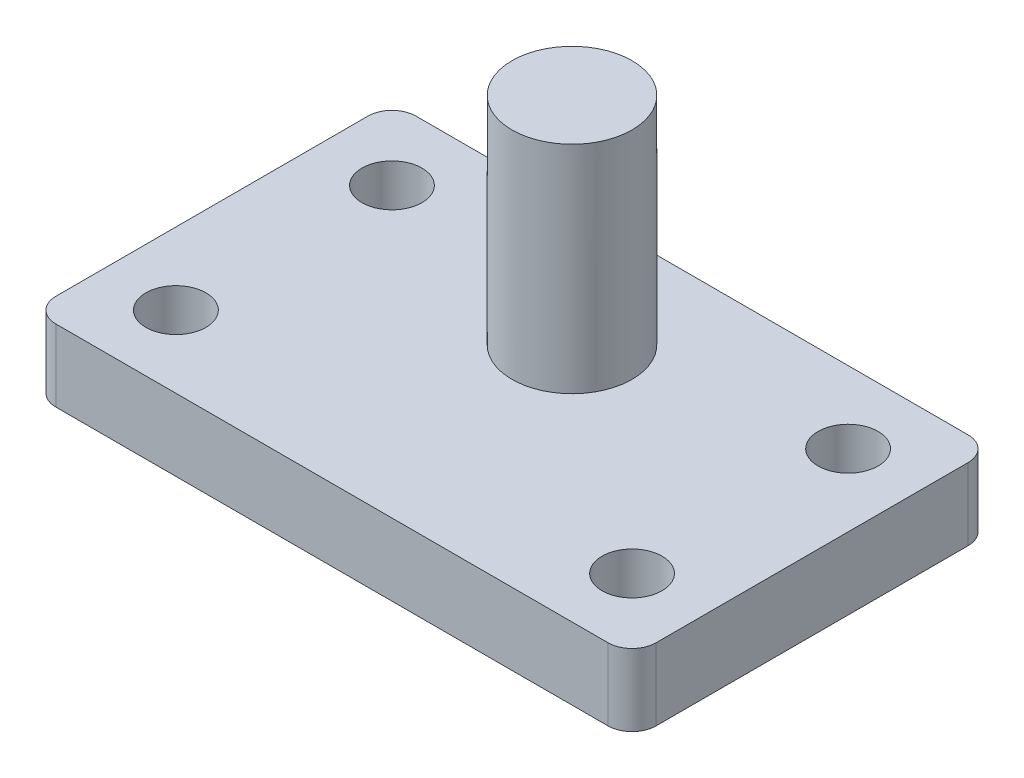
ISO-10303-21;
HEADER;
FILE_DESCRIPTION(('STEP AP214'),'2;1');
FILE_NAME('part.step','',(''),(''),'','','');
FILE_SCHEMA(('AUTOMOTIVE_DESIGN { 1 0 10303 214 1 1 1 1 }'));
ENDSEC;
DATA;
#1=APPLICATION_CONTEXT('core data for automotive mechanical design processes');
#2=APPLICATION_PROTOCOL_DEFINITION('international standard','automotive_design',2000,#1);
#3=PRODUCT_CONTEXT('',#1,'mechanical');
#4=PRODUCT('Part','Part','',(#3));
#5=PRODUCT_RELATED_PRODUCT_CATEGORY('part','',(#4));
#6=PRODUCT_DEFINITION_FORMATION('','',#4);
#7=PRODUCT_DEFINITION_CONTEXT('part definition',#1,'design');
#8=PRODUCT_DEFINITION('design','',#6,#7);
#9=PRODUCT_DEFINITION_SHAPE('','',#8);
#10=(LENGTH_UNIT() NAMED_UNIT(*) SI_UNIT(.MILLI.,.METRE.));
#11=(NAMED_UNIT(*) PLANE_ANGLE_UNIT() SI_UNIT($,.RADIAN.));
#12=(NAMED_UNIT(*) SI_UNIT($,.STERADIAN.) SOLID_ANGLE_UNIT());
#13=UNCERTAINTY_MEASURE_WITH_UNIT(LENGTH_MEASURE(1.E-05),#10,'distance_accuracy_value','');
#14=(GEOMETRIC_REPRESENTATION_CONTEXT(3) GLOBAL_UNCERTAINTY_ASSIGNED_CONTEXT((#13)) GLOBAL_UNIT_ASSIGNED_CONTEXT((#10,
#11,#12)) REPRESENTATION_CONTEXT('',''));
#15=CARTESIAN_POINT('',(0.,0.,0.));
#16=DIRECTION('',(0.,0.,1.));
#17=DIRECTION('',(1.,0.,0.));
#18=AXIS2_PLACEMENT_3D('',#15,#16,#17);
#19=CARTESIAN_POINT('',(-115.,30.,65.));
#20=DIRECTION('',(0.,-1.,0.));
#21=DIRECTION('',(0.,0.,-1.));
#22=AXIS2_PLACEMENT_3D('',#19,#20,#21);
#23=PLANE('',#22);
#24=CARTESIAN_POINT('',(-95.,30.,45.));
#25=DIRECTION('',(0.,1.,0.));
#26=DIRECTION('',(0.,0.,-1.));
#27=AXIS2_PLACEMENT_3D('',#24,#25,#26);
#28=CIRCLE('',#27,12.5);
#29=CARTESIAN_POINT('',(-95.,30.,32.5));
#30=VERTEX_POINT('',#29);
#31=EDGE_CURVE('E204',#30,#30,#28,.T.);
#32=ORIENTED_EDGE('',*,*,#31,.F.);
#33=EDGE_LOOP('',(#32));
#34=FACE_BOUND('',#33,.T.);
#35=CARTESIAN_POINT('',(95.,30.,45.));
#36=DIRECTION('',(0.,1.,0.));
#37=DIRECTION('',(0.,0.,-1.));
#38=AXIS2_PLACEMENT_3D('',#35,#36,#37);
#39=CIRCLE('',#38,12.5);
#40=CARTESIAN_POINT('',(95.,30.,32.5));
#41=VERTEX_POINT('',#40);
#42=EDGE_CURVE('E198',#41,#41,#39,.T.);
#43=ORIENTED_EDGE('',*,*,#42,.F.);
#44=EDGE_LOOP('',(#43));
#45=FACE_BOUND('',#44,.T.);
#46=CARTESIAN_POINT('',(95.,30.,-45.));
#47=DIRECTION('',(0.,1.,0.));
#48=DIRECTION('',(0.,0.,1.));
#49=AXIS2_PLACEMENT_3D('',#46,#47,#48);
#50=CIRCLE('',#49,12.5);
#51=CARTESIAN_POINT('',(95.,30.,-32.5));
#52=VERTEX_POINT('',#51);
#53=EDGE_CURVE('E192',#52,#52,#50,.T.);
#54=ORIENTED_EDGE('',*,*,#53,.F.);
#55=EDGE_LOOP('',(#54));
#56=FACE_BOUND('',#55,.T.);
#57=CARTESIAN_POINT('',(-95.,30.,-45.));
#58=DIRECTION('',(0.,1.,0.));
#59=DIRECTION('',(0.,0.,1.));
#60=AXIS2_PLACEMENT_3D('',#57,#58,#59);
#61=CIRCLE('',#60,12.5);
#62=CARTESIAN_POINT('',(-95.,30.,-32.5));
#63=VERTEX_POINT('',#62);
#64=EDGE_CURVE('E186',#63,#63,#61,.T.);
#65=ORIENTED_EDGE('',*,*,#64,.F.);
#66=EDGE_LOOP('',(#65));
#67=FACE_BOUND('',#66,.T.);
#68=CARTESIAN_POINT('',(-115.,30.,65.));
#69=DIRECTION('',(0.,1.,0.));
#70=DIRECTION('',(0.,0.,-1.));
#71=AXIS2_PLACEMENT_3D('',#68,#69,#70);
#72=CIRCLE('',#71,9.99999999999999);
#73=CARTESIAN_POINT('',(-125.,30.,64.9999999999999));
#74=VERTEX_POINT('',#73);
#75=CARTESIAN_POINT('',(-115.,30.,75.));
#76=VERTEX_POINT('',#75);
#77=EDGE_CURVE('E146',#74,#76,#72,.T.);
#78=ORIENTED_EDGE('',*,*,#77,.T.);
#79=DIRECTION('',(1.,0.,0.));
#80=VECTOR('',#79,1.);
#81=CARTESIAN_POINT('',(115.,30.,75.));
#82=LINE('',#81,#80);
#83=CARTESIAN_POINT('',(115.,30.,75.));
#84=VERTEX_POINT('',#83);
#85=EDGE_CURVE('E94',#76,#84,#82,.T.);
#86=ORIENTED_EDGE('',*,*,#85,.T.);
#87=CARTESIAN_POINT('',(115.,30.,65.));
#88=DIRECTION('',(0.,1.,0.));
#89=DIRECTION('',(0.,0.,1.));
#90=AXIS2_PLACEMENT_3D('',#87,#88,#89);
#91=CIRCLE('',#90,9.99999999999999);
#92=CARTESIAN_POINT('',(125.,30.,64.9999999999999));
#93=VERTEX_POINT('',#92);
#94=EDGE_CURVE('E177',#84,#93,#91,.T.);
#95=ORIENTED_EDGE('',*,*,#94,.T.);
#96=DIRECTION('',(0.,0.,-1.));
#97=VECTOR('',#96,1.);
#98=CARTESIAN_POINT('',(125.,30.,64.9999999999999));
#99=LINE('',#98,#97);
#100=CARTESIAN_POINT('',(125.,30.,-64.9999999999999));
#101=VERTEX_POINT('',#100);
#102=EDGE_CURVE('E176',#93,#101,#99,.T.);
#103=ORIENTED_EDGE('',*,*,#102,.T.);
#104=CARTESIAN_POINT('',(115.,30.,-65.));
#105=DIRECTION('',(0.,1.,0.));
#106=DIRECTION('',(0.,0.,1.));
#107=AXIS2_PLACEMENT_3D('',#104,#105,#106);
#108=CIRCLE('',#107,9.99999999999999);
#109=CARTESIAN_POINT('',(115.,30.,-75.));
#110=VERTEX_POINT('',#109);
#111=EDGE_CURVE('E113',#101,#110,#108,.T.);
#112=ORIENTED_EDGE('',*,*,#111,.T.);
#113=DIRECTION('',(-1.,0.,0.));
#114=VECTOR('',#113,1.);
#115=CARTESIAN_POINT('',(115.,30.,-75.));
#116=LINE('',#115,#114);
#117=CARTESIAN_POINT('',(-115.,30.,-75.));
#118=VERTEX_POINT('',#117);
#119=EDGE_CURVE('E107',#110,#118,#116,.T.);
#120=ORIENTED_EDGE('',*,*,#119,.T.);
#121=CARTESIAN_POINT('',(-115.,30.,-65.));
#122=DIRECTION('',(0.,1.,0.));
#123=DIRECTION('',(0.,0.,1.));
#124=AXIS2_PLACEMENT_3D('',#121,#122,#123);
#125=CIRCLE('',#124,9.99999999999999);
#126=CARTESIAN_POINT('',(-125.,30.,-64.9999999999999));
#127=VERTEX_POINT('',#126);
#128=EDGE_CURVE('E111',#118,#127,#125,.T.);
#129=ORIENTED_EDGE('',*,*,#128,.T.);
#130=DIRECTION('',(0.,0.,1.));
#131=VECTOR('',#130,1.);
#132=CARTESIAN_POINT('',(-125.,30.,64.9999999999999));
#133=LINE('',#132,#131);
#134=EDGE_CURVE('E50',#127,#74,#133,.T.);
#135=ORIENTED_EDGE('',*,*,#134,.T.);
#136=EDGE_LOOP('',(#78,#86,#95,#103,#112,#120,#129,#135));
#137=FACE_BOUND('',#136,.T.);
#138=CARTESIAN_POINT('',(0.,30.,-25.));
#139=DIRECTION('',(0.,-1.,0.));
#140=DIRECTION('',(0.,0.,-1.));
#141=AXIS2_PLACEMENT_3D('',#138,#139,#140);
#142=CIRCLE('',#141,25.);
#143=CARTESIAN_POINT('',(0.,30.,-50.));
#144=VERTEX_POINT('',#143);
#145=EDGE_CURVE('E11',#144,#144,#142,.F.);
#146=ORIENTED_EDGE('',*,*,#145,.F.);
#147=EDGE_LOOP('',(#146));
#148=FACE_BOUND('',#147,.T.);
#149=ADVANCED_FACE('F33',(#34,#45,#56,#67,#137,#148),#23,.F.);
#150=CARTESIAN_POINT('',(-115.,30.,65.));
#151=DIRECTION('',(0.,-1.,0.));
#152=DIRECTION('',(0.,0.,-1.));
#153=AXIS2_PLACEMENT_3D('',#150,#151,#152);
#154=CYLINDRICAL_SURFACE('',#153,9.99999999999999);
#155=CARTESIAN_POINT('',(-115.,0.,65.));
#156=DIRECTION('',(0.,1.,0.));
#157=DIRECTION('',(0.,0.,-1.));
#158=AXIS2_PLACEMENT_3D('',#155,#156,#157);
#159=CIRCLE('',#158,9.99999999999999);
#160=CARTESIAN_POINT('',(-125.,0.,64.9999999999999));
#161=VERTEX_POINT('',#160);
#162=CARTESIAN_POINT('',(-115.,0.,75.));
#163=VERTEX_POINT('',#162);
#164=EDGE_CURVE('E131',#161,#163,#159,.T.);
#165=ORIENTED_EDGE('',*,*,#164,.T.);
#166=DIRECTION('',(0.,-1.,0.));
#167=VECTOR('',#166,1.);
#168=CARTESIAN_POINT('',(-115.,30.,75.));
#169=LINE('',#168,#167);
#170=EDGE_CURVE('E42',#76,#163,#169,.T.);
#171=ORIENTED_EDGE('',*,*,#170,.F.);
#172=ORIENTED_EDGE('',*,*,#77,.F.);
#173=DIRECTION('',(0.,-1.,0.));
#174=VECTOR('',#173,1.);
#175=CARTESIAN_POINT('',(-125.,30.,64.9999999999999));
#176=LINE('',#175,#174);
#177=EDGE_CURVE('E127',#74,#161,#176,.T.);
#178=ORIENTED_EDGE('',*,*,#177,.T.);
#179=EDGE_LOOP('',(#165,#171,#172,#178));
#180=FACE_BOUND('',#179,.T.);
#181=ADVANCED_FACE('F35',(#180),#154,.T.);
#182=CARTESIAN_POINT('',(115.,30.,75.));
#183=DIRECTION('',(0.,0.,-1.));
#184=DIRECTION('',(-1.,0.,0.));
#185=AXIS2_PLACEMENT_3D('',#182,#183,#184);
#186=PLANE('',#185);
#187=DIRECTION('',(1.,0.,0.));
#188=VECTOR('',#187,1.);
#189=CARTESIAN_POINT('',(115.,0.,75.));
#190=LINE('',#189,#188);
#191=CARTESIAN_POINT('',(115.,0.,75.));
#192=VERTEX_POINT('',#191);
#193=EDGE_CURVE('E134',#163,#192,#190,.T.);
#194=ORIENTED_EDGE('',*,*,#193,.T.);
#195=DIRECTION('',(0.,-1.,0.));
#196=VECTOR('',#195,1.);
#197=CARTESIAN_POINT('',(115.,30.,75.));
#198=LINE('',#197,#196);
#199=EDGE_CURVE('E156',#84,#192,#198,.T.);
#200=ORIENTED_EDGE('',*,*,#199,.F.);
#201=ORIENTED_EDGE('',*,*,#85,.F.);
#202=ORIENTED_EDGE('',*,*,#170,.T.);
#203=EDGE_LOOP('',(#194,#200,#201,#202));
#204=FACE_BOUND('',#203,.T.);
#205=ADVANCED_FACE('F159',(#204),#186,.F.);
#206=CARTESIAN_POINT('',(115.,30.,65.));
#207=DIRECTION('',(0.,-1.,0.));
#208=DIRECTION('',(0.,0.,-1.));
#209=AXIS2_PLACEMENT_3D('',#206,#207,#208);
#210=CYLINDRICAL_SURFACE('',#209,9.99999999999999);
#211=CARTESIAN_POINT('',(115.,0.,65.));
#212=DIRECTION('',(0.,1.,0.));
#213=DIRECTION('',(0.,0.,1.));
#214=AXIS2_PLACEMENT_3D('',#211,#212,#213);
#215=CIRCLE('',#214,9.99999999999999);
#216=CARTESIAN_POINT('',(125.,0.,64.9999999999999));
#217=VERTEX_POINT('',#216);
#218=EDGE_CURVE('E137',#192,#217,#215,.T.);
#219=ORIENTED_EDGE('',*,*,#218,.T.);
#220=DIRECTION('',(0.,-1.,0.));
#221=VECTOR('',#220,1.);
#222=CARTESIAN_POINT('',(125.,30.,64.9999999999999));
#223=LINE('',#222,#221);
#224=EDGE_CURVE('E153',#93,#217,#223,.T.);
#225=ORIENTED_EDGE('',*,*,#224,.F.);
#226=ORIENTED_EDGE('',*,*,#94,.F.);
#227=ORIENTED_EDGE('',*,*,#199,.T.);
#228=EDGE_LOOP('',(#219,#225,#226,#227));
#229=FACE_BOUND('',#228,.T.);
#230=ADVANCED_FACE('F170',(#229),#210,.T.);
#231=CARTESIAN_POINT('',(125.,30.,64.9999999999999));
#232=DIRECTION('',(-1.,0.,0.));
#233=DIRECTION('',(0.,0.,1.));
#234=AXIS2_PLACEMENT_3D('',#231,#232,#233);
#235=PLANE('',#234);
#236=DIRECTION('',(0.,0.,-1.));
#237=VECTOR('',#236,1.);
#238=CARTESIAN_POINT('',(125.,0.,64.9999999999999));
#239=LINE('',#238,#237);
#240=CARTESIAN_POINT('',(125.,0.,-64.9999999999999));
#241=VERTEX_POINT('',#240);
#242=EDGE_CURVE('E139',#217,#241,#239,.T.);
#243=ORIENTED_EDGE('',*,*,#242,.T.);
#244=DIRECTION('',(0.,-1.,0.));
#245=VECTOR('',#244,1.);
#246=CARTESIAN_POINT('',(125.,30.,-64.9999999999999));
#247=LINE('',#246,#245);
#248=EDGE_CURVE('E150',#101,#241,#247,.T.);
#249=ORIENTED_EDGE('',*,*,#248,.F.);
#250=ORIENTED_EDGE('',*,*,#102,.F.);
#251=ORIENTED_EDGE('',*,*,#224,.T.);
#252=EDGE_LOOP('',(#243,#249,#250,#251));
#253=FACE_BOUND('',#252,.T.);
#254=ADVANCED_FACE('F174',(#253),#235,.F.);
#255=CARTESIAN_POINT('',(115.,30.,-65.));
#256=DIRECTION('',(0.,-1.,0.));
#257=DIRECTION('',(0.,0.,-1.));
#258=AXIS2_PLACEMENT_3D('',#255,#256,#257);
#259=CYLINDRICAL_SURFACE('',#258,9.99999999999999);
#260=CARTESIAN_POINT('',(115.,0.,-65.));
#261=DIRECTION('',(0.,1.,0.));
#262=DIRECTION('',(0.,0.,1.));
#263=AXIS2_PLACEMENT_3D('',#260,#261,#262);
#264=CIRCLE('',#263,9.99999999999999);
#265=CARTESIAN_POINT('',(115.,0.,-75.));
#266=VERTEX_POINT('',#265);
#267=EDGE_CURVE('E141',#241,#266,#264,.T.);
#268=ORIENTED_EDGE('',*,*,#267,.T.);
#269=DIRECTION('',(0.,-1.,0.));
#270=VECTOR('',#269,1.);
#271=CARTESIAN_POINT('',(115.,30.,-75.));
#272=LINE('',#271,#270);
#273=EDGE_CURVE('E122',#110,#266,#272,.T.);
#274=ORIENTED_EDGE('',*,*,#273,.F.);
#275=ORIENTED_EDGE('',*,*,#111,.F.);
#276=ORIENTED_EDGE('',*,*,#248,.T.);
#277=EDGE_LOOP('',(#268,#274,#275,#276));
#278=FACE_BOUND('',#277,.T.);
#279=ADVANCED_FACE('F258',(#278),#259,.T.);
#280=CARTESIAN_POINT('',(115.,30.,-75.));
#281=DIRECTION('',(0.,0.,1.));
#282=DIRECTION('',(1.,0.,0.));
#283=AXIS2_PLACEMENT_3D('',#280,#281,#282);
#284=PLANE('',#283);
#285=DIRECTION('',(-1.,0.,0.));
#286=VECTOR('',#285,1.);
#287=CARTESIAN_POINT('',(115.,0.,-75.));
#288=LINE('',#287,#286);
#289=CARTESIAN_POINT('',(-115.,0.,-75.));
#290=VERTEX_POINT('',#289);
#291=EDGE_CURVE('E121',#266,#290,#288,.T.);
#292=ORIENTED_EDGE('',*,*,#291,.T.);
#293=DIRECTION('',(0.,-1.,0.));
#294=VECTOR('',#293,1.);
#295=CARTESIAN_POINT('',(-115.,30.,-75.));
#296=LINE('',#295,#294);
#297=EDGE_CURVE('E118',#118,#290,#296,.T.);
#298=ORIENTED_EDGE('',*,*,#297,.F.);
#299=ORIENTED_EDGE('',*,*,#119,.F.);
#300=ORIENTED_EDGE('',*,*,#273,.T.);
#301=EDGE_LOOP('',(#292,#298,#299,#300));
#302=FACE_BOUND('',#301,.T.);
#303=ADVANCED_FACE('F119',(#302),#284,.F.);
#304=CARTESIAN_POINT('',(-115.,30.,-65.));
#305=DIRECTION('',(0.,-1.,0.));
#306=DIRECTION('',(0.,0.,-1.));
#307=AXIS2_PLACEMENT_3D('',#304,#305,#306);
#308=CYLINDRICAL_SURFACE('',#307,9.99999999999999);
#309=CARTESIAN_POINT('',(-115.,0.,-65.));
#310=DIRECTION('',(0.,1.,0.));
#311=DIRECTION('',(0.,0.,1.));
#312=AXIS2_PLACEMENT_3D('',#309,#310,#311);
#313=CIRCLE('',#312,9.99999999999999);
#314=CARTESIAN_POINT('',(-125.,0.,-64.9999999999999));
#315=VERTEX_POINT('',#314);
#316=EDGE_CURVE('E79',#290,#315,#313,.T.);
#317=ORIENTED_EDGE('',*,*,#316,.T.);
#318=DIRECTION('',(0.,-1.,0.));
#319=VECTOR('',#318,1.);
#320=CARTESIAN_POINT('',(-125.,30.,-64.9999999999999));
#321=LINE('',#320,#319);
#322=EDGE_CURVE('E123',#127,#315,#321,.T.);
#323=ORIENTED_EDGE('',*,*,#322,.F.);
#324=ORIENTED_EDGE('',*,*,#128,.F.);
#325=ORIENTED_EDGE('',*,*,#297,.T.);
#326=EDGE_LOOP('',(#317,#323,#324,#325));
#327=FACE_BOUND('',#326,.T.);
#328=ADVANCED_FACE('F125',(#327),#308,.T.);
#329=CARTESIAN_POINT('',(-125.,30.,64.9999999999999));
#330=DIRECTION('',(1.,0.,0.));
#331=DIRECTION('',(0.,0.,-1.));
#332=AXIS2_PLACEMENT_3D('',#329,#330,#331);
#333=PLANE('',#332);
#334=DIRECTION('',(0.,0.,1.));
#335=VECTOR('',#334,1.);
#336=CARTESIAN_POINT('',(-125.,0.,64.9999999999999));
#337=LINE('',#336,#335);
#338=EDGE_CURVE('E85',#315,#161,#337,.T.);
#339=ORIENTED_EDGE('',*,*,#338,.T.);
#340=ORIENTED_EDGE('',*,*,#177,.F.);
#341=ORIENTED_EDGE('',*,*,#134,.F.);
#342=ORIENTED_EDGE('',*,*,#322,.T.);
#343=EDGE_LOOP('',(#339,#340,#341,#342));
#344=FACE_BOUND('',#343,.T.);
#345=ADVANCED_FACE('F251',(#344),#333,.F.);
#346=CARTESIAN_POINT('',(-115.,0.,65.));
#347=DIRECTION('',(0.,-1.,0.));
#348=DIRECTION('',(0.,0.,-1.));
#349=AXIS2_PLACEMENT_3D('',#346,#347,#348);
#350=PLANE('',#349);
#351=CARTESIAN_POINT('',(-95.,0.,45.));
#352=DIRECTION('',(0.,1.,0.));
#353=DIRECTION('',(0.,0.,-1.));
#354=AXIS2_PLACEMENT_3D('',#351,#352,#353);
#355=CIRCLE('',#354,12.5);
#356=CARTESIAN_POINT('',(-95.,0.,32.5));
#357=VERTEX_POINT('',#356);
#358=EDGE_CURVE('E201',#357,#357,#355,.T.);
#359=ORIENTED_EDGE('',*,*,#358,.T.);
#360=EDGE_LOOP('',(#359));
#361=FACE_BOUND('',#360,.T.);
#362=CARTESIAN_POINT('',(95.,0.,45.));
#363=DIRECTION('',(0.,1.,0.));
#364=DIRECTION('',(0.,0.,-1.));
#365=AXIS2_PLACEMENT_3D('',#362,#363,#364);
#366=CIRCLE('',#365,12.5);
#367=CARTESIAN_POINT('',(95.,0.,32.5));
#368=VERTEX_POINT('',#367);
#369=EDGE_CURVE('E195',#368,#368,#366,.T.);
#370=ORIENTED_EDGE('',*,*,#369,.T.);
#371=EDGE_LOOP('',(#370));
#372=FACE_BOUND('',#371,.T.);
#373=CARTESIAN_POINT('',(95.,0.,-45.));
#374=DIRECTION('',(0.,1.,0.));
#375=DIRECTION('',(0.,0.,1.));
#376=AXIS2_PLACEMENT_3D('',#373,#374,#375);
#377=CIRCLE('',#376,12.5);
#378=CARTESIAN_POINT('',(95.,0.,-32.5));
#379=VERTEX_POINT('',#378);
#380=EDGE_CURVE('E189',#379,#379,#377,.T.);
#381=ORIENTED_EDGE('',*,*,#380,.T.);
#382=EDGE_LOOP('',(#381));
#383=FACE_BOUND('',#382,.T.);
#384=CARTESIAN_POINT('',(-95.,0.,-45.));
#385=DIRECTION('',(0.,1.,0.));
#386=DIRECTION('',(0.,0.,1.));
#387=AXIS2_PLACEMENT_3D('',#384,#385,#386);
#388=CIRCLE('',#387,12.5);
#389=CARTESIAN_POINT('',(-95.,0.,-32.5));
#390=VERTEX_POINT('',#389);
#391=EDGE_CURVE('E185',#390,#390,#388,.T.);
#392=ORIENTED_EDGE('',*,*,#391,.T.);
#393=EDGE_LOOP('',(#392));
#394=FACE_BOUND('',#393,.T.);
#395=ORIENTED_EDGE('',*,*,#164,.F.);
#396=ORIENTED_EDGE('',*,*,#338,.F.);
#397=ORIENTED_EDGE('',*,*,#316,.F.);
#398=ORIENTED_EDGE('',*,*,#291,.F.);
#399=ORIENTED_EDGE('',*,*,#267,.F.);
#400=ORIENTED_EDGE('',*,*,#242,.F.);
#401=ORIENTED_EDGE('',*,*,#218,.F.);
#402=ORIENTED_EDGE('',*,*,#193,.F.);
#403=EDGE_LOOP('',(#395,#396,#397,#398,#399,#400,#401,#402));
#404=FACE_BOUND('',#403,.T.);
#405=ADVANCED_FACE('F164',(#361,#372,#383,#394,#404),#350,.T.);
#406=CARTESIAN_POINT('',(0.,120.,-25.));
#407=DIRECTION('',(0.,-1.,0.));
#408=DIRECTION('',(0.,0.,-1.));
#409=AXIS2_PLACEMENT_3D('',#406,#407,#408);
#410=CYLINDRICAL_SURFACE('',#409,25.);
#411=CARTESIAN_POINT('',(0.,120.,-25.));
#412=DIRECTION('',(0.,1.,0.));
#413=DIRECTION('',(0.,0.,1.));
#414=AXIS2_PLACEMENT_3D('',#411,#412,#413);
#415=CIRCLE('',#414,25.);
#416=CARTESIAN_POINT('',(0.,120.,0.));
#417=VERTEX_POINT('',#416);
#418=EDGE_CURVE('E135',#417,#417,#415,.T.);
#419=ORIENTED_EDGE('',*,*,#418,.F.);
#420=EDGE_LOOP('',(#419));
#421=FACE_BOUND('',#420,.T.);
#422=ORIENTED_EDGE('',*,*,#145,.T.);
#423=EDGE_LOOP('',(#422));
#424=FACE_BOUND('',#423,.T.);
#425=ADVANCED_FACE('F240',(#421,#424),#410,.T.);
#426=CARTESIAN_POINT('',(0.,120.,-25.));
#427=DIRECTION('',(0.,1.,0.));
#428=DIRECTION('',(0.,0.,1.));
#429=AXIS2_PLACEMENT_3D('',#426,#427,#428);
#430=PLANE('',#429);
#431=ORIENTED_EDGE('',*,*,#418,.T.);
#432=EDGE_LOOP('',(#431));
#433=FACE_BOUND('',#432,.T.);
#434=ADVANCED_FACE('F231',(#433),#430,.T.);
#435=CARTESIAN_POINT('',(-95.,0.,-45.));
#436=DIRECTION('',(0.,1.,0.));
#437=DIRECTION('',(0.,0.,1.));
#438=AXIS2_PLACEMENT_3D('',#435,#436,#437);
#439=CYLINDRICAL_SURFACE('',#438,12.5);
#440=ORIENTED_EDGE('',*,*,#391,.F.);
#441=EDGE_LOOP('',(#440));
#442=FACE_BOUND('',#441,.T.);
#443=ORIENTED_EDGE('',*,*,#64,.T.);
#444=EDGE_LOOP('',(#443));
#445=FACE_BOUND('',#444,.T.);
#446=ADVANCED_FACE('F228',(#442,#445),#439,.F.);
#447=CARTESIAN_POINT('',(95.,0.,-45.));
#448=DIRECTION('',(0.,1.,0.));
#449=DIRECTION('',(0.,0.,1.));
#450=AXIS2_PLACEMENT_3D('',#447,#448,#449);
#451=CYLINDRICAL_SURFACE('',#450,12.5);
#452=ORIENTED_EDGE('',*,*,#380,.F.);
#453=EDGE_LOOP('',(#452));
#454=FACE_BOUND('',#453,.T.);
#455=ORIENTED_EDGE('',*,*,#53,.T.);
#456=EDGE_LOOP('',(#455));
#457=FACE_BOUND('',#456,.T.);
#458=ADVANCED_FACE('F230',(#454,#457),#451,.F.);
#459=CARTESIAN_POINT('',(95.,0.,45.));
#460=DIRECTION('',(0.,1.,0.));
#461=DIRECTION('',(0.,0.,1.));
#462=AXIS2_PLACEMENT_3D('',#459,#460,#461);
#463=CYLINDRICAL_SURFACE('',#462,12.5);
#464=ORIENTED_EDGE('',*,*,#369,.F.);
#465=EDGE_LOOP('',(#464));
#466=FACE_BOUND('',#465,.T.);
#467=ORIENTED_EDGE('',*,*,#42,.T.);
#468=EDGE_LOOP('',(#467));
#469=FACE_BOUND('',#468,.T.);
#470=ADVANCED_FACE('F215',(#466,#469),#463,.F.);
#471=CARTESIAN_POINT('',(-95.,0.,45.));
#472=DIRECTION('',(0.,1.,0.));
#473=DIRECTION('',(0.,0.,1.));
#474=AXIS2_PLACEMENT_3D('',#471,#472,#473);
#475=CYLINDRICAL_SURFACE('',#474,12.5);
#476=ORIENTED_EDGE('',*,*,#358,.F.);
#477=EDGE_LOOP('',(#476));
#478=FACE_BOUND('',#477,.T.);
#479=ORIENTED_EDGE('',*,*,#31,.T.);
#480=EDGE_LOOP('',(#479));
#481=FACE_BOUND('',#480,.T.);
#482=ADVANCED_FACE('F212',(#478,#481),#475,.F.);
#483=CLOSED_SHELL('',(#149,#181,#205,#230,#254,#279,#303,#328,#345,#405,#425,#434,#446,#458,
#470,#482));
#484=MANIFOLD_SOLID_BREP('B2',#483);
#485=ADVANCED_BREP_SHAPE_REPRESENTATION('',(#18,#484),#14);
#486=SHAPE_DEFINITION_REPRESENTATION(#9,#485);
ENDSEC;
END-ISO-10303-21;
